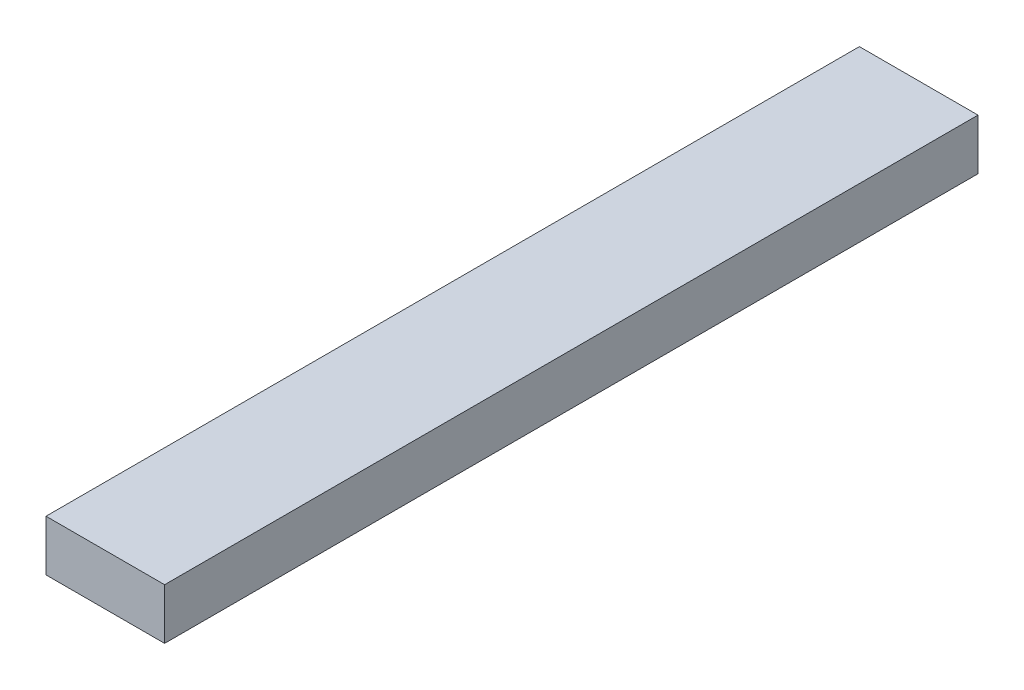
ISO-10303-21;
HEADER;
FILE_DESCRIPTION(('STEP AP214'),'2;1');
FILE_NAME('part.step','',(''),(''),'','','');
FILE_SCHEMA(('AUTOMOTIVE_DESIGN { 1 0 10303 214 1 1 1 1 }'));
ENDSEC;
DATA;
#1=APPLICATION_CONTEXT('core data for automotive mechanical design processes');
#2=APPLICATION_PROTOCOL_DEFINITION('international standard','automotive_design',2000,#1);
#3=PRODUCT_CONTEXT('',#1,'mechanical');
#4=PRODUCT('Part','Part','',(#3));
#5=PRODUCT_RELATED_PRODUCT_CATEGORY('part','',(#4));
#6=PRODUCT_DEFINITION_FORMATION('','',#4);
#7=PRODUCT_DEFINITION_CONTEXT('part definition',#1,'design');
#8=PRODUCT_DEFINITION('design','',#6,#7);
#9=PRODUCT_DEFINITION_SHAPE('','',#8);
#10=(LENGTH_UNIT() NAMED_UNIT(*) SI_UNIT(.MILLI.,.METRE.));
#11=(NAMED_UNIT(*) PLANE_ANGLE_UNIT() SI_UNIT($,.RADIAN.));
#12=(NAMED_UNIT(*) SI_UNIT($,.STERADIAN.) SOLID_ANGLE_UNIT());
#13=UNCERTAINTY_MEASURE_WITH_UNIT(LENGTH_MEASURE(1.E-05),#10,'distance_accuracy_value','');
#14=(GEOMETRIC_REPRESENTATION_CONTEXT(3) GLOBAL_UNCERTAINTY_ASSIGNED_CONTEXT((#13)) GLOBAL_UNIT_ASSIGNED_CONTEXT((#10,
#11,#12)) REPRESENTATION_CONTEXT('',''));
#15=CARTESIAN_POINT('',(0.,0.,0.));
#16=DIRECTION('',(0.,0.,1.));
#17=DIRECTION('',(1.,0.,0.));
#18=AXIS2_PLACEMENT_3D('',#15,#16,#17);
#19=CARTESIAN_POINT('',(0.,0.,609.6));
#20=DIRECTION('',(1.,0.,0.));
#21=DIRECTION('',(0.,0.,-1.));
#22=AXIS2_PLACEMENT_3D('',#19,#20,#21);
#23=PLANE('',#22);
#24=DIRECTION('',(0.,-1.,0.));
#25=VECTOR('',#24,1.);
#26=CARTESIAN_POINT('',(0.,0.,0.));
#27=LINE('',#26,#25);
#28=CARTESIAN_POINT('',(0.,38.1,0.));
#29=VERTEX_POINT('',#28);
#30=CARTESIAN_POINT('',(0.,0.,0.));
#31=VERTEX_POINT('',#30);
#32=EDGE_CURVE('E95',#29,#31,#27,.T.);
#33=ORIENTED_EDGE('',*,*,#32,.T.);
#34=DIRECTION('',(0.,0.,-1.));
#35=VECTOR('',#34,1.);
#36=CARTESIAN_POINT('',(0.,0.,609.6));
#37=LINE('',#36,#35);
#38=CARTESIAN_POINT('',(0.,0.,609.6));
#39=VERTEX_POINT('',#38);
#40=EDGE_CURVE('E11',#39,#31,#37,.T.);
#41=ORIENTED_EDGE('',*,*,#40,.F.);
#42=DIRECTION('',(0.,-1.,0.));
#43=VECTOR('',#42,1.);
#44=CARTESIAN_POINT('',(0.,0.,609.6));
#45=LINE('',#44,#43);
#46=CARTESIAN_POINT('',(0.,38.1,609.6));
#47=VERTEX_POINT('',#46);
#48=EDGE_CURVE('E83',#47,#39,#45,.T.);
#49=ORIENTED_EDGE('',*,*,#48,.F.);
#50=DIRECTION('',(0.,0.,-1.));
#51=VECTOR('',#50,1.);
#52=CARTESIAN_POINT('',(0.,38.1,609.6));
#53=LINE('',#52,#51);
#54=EDGE_CURVE('E91',#47,#29,#53,.T.);
#55=ORIENTED_EDGE('',*,*,#54,.T.);
#56=EDGE_LOOP('',(#33,#41,#49,#55));
#57=FACE_BOUND('',#56,.T.);
#58=ADVANCED_FACE('F32',(#57),#23,.F.);
#59=CARTESIAN_POINT('',(0.,0.,609.6));
#60=DIRECTION('',(0.,1.,0.));
#61=DIRECTION('',(0.,0.,1.));
#62=AXIS2_PLACEMENT_3D('',#59,#60,#61);
#63=PLANE('',#62);
#64=DIRECTION('',(1.,0.,0.));
#65=VECTOR('',#64,1.);
#66=CARTESIAN_POINT('',(0.,0.,0.));
#67=LINE('',#66,#65);
#68=CARTESIAN_POINT('',(88.9,0.,0.));
#69=VERTEX_POINT('',#68);
#70=EDGE_CURVE('E87',#31,#69,#67,.T.);
#71=ORIENTED_EDGE('',*,*,#70,.T.);
#72=DIRECTION('',(0.,0.,-1.));
#73=VECTOR('',#72,1.);
#74=CARTESIAN_POINT('',(88.9,0.,609.6));
#75=LINE('',#74,#73);
#76=CARTESIAN_POINT('',(88.9,0.,609.6));
#77=VERTEX_POINT('',#76);
#78=EDGE_CURVE('E40',#77,#69,#75,.T.);
#79=ORIENTED_EDGE('',*,*,#78,.F.);
#80=DIRECTION('',(1.,0.,0.));
#81=VECTOR('',#80,1.);
#82=CARTESIAN_POINT('',(0.,0.,609.6));
#83=LINE('',#82,#81);
#84=EDGE_CURVE('E78',#39,#77,#83,.T.);
#85=ORIENTED_EDGE('',*,*,#84,.F.);
#86=ORIENTED_EDGE('',*,*,#40,.T.);
#87=EDGE_LOOP('',(#71,#79,#85,#86));
#88=FACE_BOUND('',#87,.T.);
#89=ADVANCED_FACE('F86',(#88),#63,.F.);
#90=CARTESIAN_POINT('',(88.9,0.,609.6));
#91=DIRECTION('',(-1.,0.,0.));
#92=DIRECTION('',(0.,0.,1.));
#93=AXIS2_PLACEMENT_3D('',#90,#91,#92);
#94=PLANE('',#93);
#95=DIRECTION('',(0.,1.,0.));
#96=VECTOR('',#95,1.);
#97=CARTESIAN_POINT('',(88.9,0.,0.));
#98=LINE('',#97,#96);
#99=CARTESIAN_POINT('',(88.9,38.1,0.));
#100=VERTEX_POINT('',#99);
#101=EDGE_CURVE('E65',#69,#100,#98,.T.);
#102=ORIENTED_EDGE('',*,*,#101,.T.);
#103=DIRECTION('',(0.,0.,-1.));
#104=VECTOR('',#103,1.);
#105=CARTESIAN_POINT('',(88.9,38.1,609.6));
#106=LINE('',#105,#104);
#107=CARTESIAN_POINT('',(88.9,38.1,609.6));
#108=VERTEX_POINT('',#107);
#109=EDGE_CURVE('E88',#108,#100,#106,.T.);
#110=ORIENTED_EDGE('',*,*,#109,.F.);
#111=DIRECTION('',(0.,1.,0.));
#112=VECTOR('',#111,1.);
#113=CARTESIAN_POINT('',(88.9,0.,609.6));
#114=LINE('',#113,#112);
#115=EDGE_CURVE('E81',#77,#108,#114,.T.);
#116=ORIENTED_EDGE('',*,*,#115,.F.);
#117=ORIENTED_EDGE('',*,*,#78,.T.);
#118=EDGE_LOOP('',(#102,#110,#116,#117));
#119=FACE_BOUND('',#118,.T.);
#120=ADVANCED_FACE('F89',(#119),#94,.F.);
#121=CARTESIAN_POINT('',(0.,38.1,609.6));
#122=DIRECTION('',(0.,-1.,0.));
#123=DIRECTION('',(0.,0.,-1.));
#124=AXIS2_PLACEMENT_3D('',#121,#122,#123);
#125=PLANE('',#124);
#126=DIRECTION('',(-1.,0.,0.));
#127=VECTOR('',#126,1.);
#128=CARTESIAN_POINT('',(0.,38.1,0.));
#129=LINE('',#128,#127);
#130=EDGE_CURVE('E71',#100,#29,#129,.T.);
#131=ORIENTED_EDGE('',*,*,#130,.T.);
#132=ORIENTED_EDGE('',*,*,#54,.F.);
#133=DIRECTION('',(-1.,0.,0.));
#134=VECTOR('',#133,1.);
#135=CARTESIAN_POINT('',(0.,38.1,609.6));
#136=LINE('',#135,#134);
#137=EDGE_CURVE('E48',#108,#47,#136,.T.);
#138=ORIENTED_EDGE('',*,*,#137,.F.);
#139=ORIENTED_EDGE('',*,*,#109,.T.);
#140=EDGE_LOOP('',(#131,#132,#138,#139));
#141=FACE_BOUND('',#140,.T.);
#142=ADVANCED_FACE('F102',(#141),#125,.F.);
#143=CARTESIAN_POINT('',(0.,0.,609.6));
#144=DIRECTION('',(0.,0.,-1.));
#145=DIRECTION('',(-1.,0.,0.));
#146=AXIS2_PLACEMENT_3D('',#143,#144,#145);
#147=PLANE('',#146);
#148=ORIENTED_EDGE('',*,*,#48,.T.);
#149=ORIENTED_EDGE('',*,*,#84,.T.);
#150=ORIENTED_EDGE('',*,*,#115,.T.);
#151=ORIENTED_EDGE('',*,*,#137,.T.);
#152=EDGE_LOOP('',(#148,#149,#150,#151));
#153=FACE_BOUND('',#152,.T.);
#154=ADVANCED_FACE('F79',(#153),#147,.F.);
#155=CARTESIAN_POINT('',(0.,0.,0.));
#156=DIRECTION('',(0.,0.,-1.));
#157=DIRECTION('',(-1.,0.,0.));
#158=AXIS2_PLACEMENT_3D('',#155,#156,#157);
#159=PLANE('',#158);
#160=ORIENTED_EDGE('',*,*,#32,.F.);
#161=ORIENTED_EDGE('',*,*,#130,.F.);
#162=ORIENTED_EDGE('',*,*,#101,.F.);
#163=ORIENTED_EDGE('',*,*,#70,.F.);
#164=EDGE_LOOP('',(#160,#161,#162,#163));
#165=FACE_BOUND('',#164,.T.);
#166=ADVANCED_FACE('F105',(#165),#159,.T.);
#167=CLOSED_SHELL('',(#58,#89,#120,#142,#154,#166));
#168=MANIFOLD_SOLID_BREP('B2',#167);
#169=ADVANCED_BREP_SHAPE_REPRESENTATION('',(#18,#168),#14);
#170=SHAPE_DEFINITION_REPRESENTATION(#9,#169);
ENDSEC;
END-ISO-10303-21;
